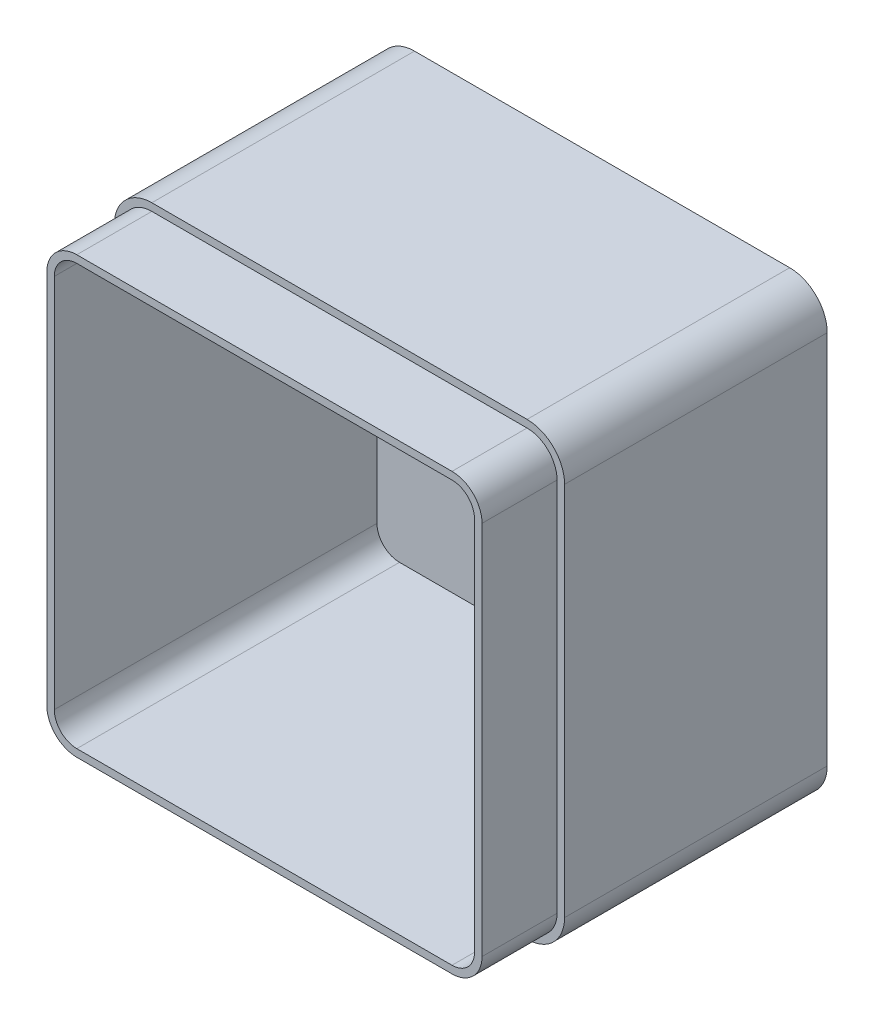
ISO-10303-21;
HEADER;
FILE_DESCRIPTION(('STEP AP214'),'2;1');
FILE_NAME('part.step','',(''),(''),'','','');
FILE_SCHEMA(('AUTOMOTIVE_DESIGN { 1 0 10303 214 1 1 1 1 }'));
ENDSEC;
DATA;
#1=APPLICATION_CONTEXT('core data for automotive mechanical design processes');
#2=APPLICATION_PROTOCOL_DEFINITION('international standard','automotive_design',2000,#1);
#3=PRODUCT_CONTEXT('',#1,'mechanical');
#4=PRODUCT('Part','Part','',(#3));
#5=PRODUCT_RELATED_PRODUCT_CATEGORY('part','',(#4));
#6=PRODUCT_DEFINITION_FORMATION('','',#4);
#7=PRODUCT_DEFINITION_CONTEXT('part definition',#1,'design');
#8=PRODUCT_DEFINITION('design','',#6,#7);
#9=PRODUCT_DEFINITION_SHAPE('','',#8);
#10=(LENGTH_UNIT() NAMED_UNIT(*) SI_UNIT(.MILLI.,.METRE.));
#11=(NAMED_UNIT(*) PLANE_ANGLE_UNIT() SI_UNIT($,.RADIAN.));
#12=(NAMED_UNIT(*) SI_UNIT($,.STERADIAN.) SOLID_ANGLE_UNIT());
#13=UNCERTAINTY_MEASURE_WITH_UNIT(LENGTH_MEASURE(1.E-05),#10,'distance_accuracy_value','');
#14=(GEOMETRIC_REPRESENTATION_CONTEXT(3) GLOBAL_UNCERTAINTY_ASSIGNED_CONTEXT((#13)) GLOBAL_UNIT_ASSIGNED_CONTEXT((#10,
#11,#12)) REPRESENTATION_CONTEXT('',''));
#15=CARTESIAN_POINT('',(0.,0.,0.));
#16=DIRECTION('',(0.,0.,1.));
#17=DIRECTION('',(1.,0.,0.));
#18=AXIS2_PLACEMENT_3D('',#15,#16,#17);
#19=CARTESIAN_POINT('',(0.,0.,90.));
#20=DIRECTION('',(0.,0.,-1.));
#21=DIRECTION('',(-1.,0.,0.));
#22=AXIS2_PLACEMENT_3D('',#19,#20,#21);
#23=PLANE('',#22);
#24=DIRECTION('',(1.,0.,0.));
#25=VECTOR('',#24,1.);
#26=CARTESIAN_POINT('',(0.,4.,90.));
#27=LINE('',#26,#25);
#28=CARTESIAN_POINT('',(9.99999999999999,4.,90.));
#29=VERTEX_POINT('',#28);
#30=CARTESIAN_POINT('',(110.,4.,90.));
#31=VERTEX_POINT('',#30);
#32=EDGE_CURVE('E317',#29,#31,#27,.T.);
#33=ORIENTED_EDGE('',*,*,#32,.F.);
#34=CARTESIAN_POINT('',(9.99999999999999,10.,90.));
#35=DIRECTION('',(0.,0.,-1.));
#36=DIRECTION('',(-1.,0.,0.));
#37=AXIS2_PLACEMENT_3D('',#34,#35,#36);
#38=CIRCLE('',#37,6.);
#39=CARTESIAN_POINT('',(4.,10.,90.));
#40=VERTEX_POINT('',#39);
#41=EDGE_CURVE('E318',#40,#29,#38,.F.);
#42=ORIENTED_EDGE('',*,*,#41,.F.);
#43=DIRECTION('',(0.,-1.,0.));
#44=VECTOR('',#43,1.);
#45=CARTESIAN_POINT('',(4.,0.,90.));
#46=LINE('',#45,#44);
#47=CARTESIAN_POINT('',(3.99999999999999,110.,90.));
#48=VERTEX_POINT('',#47);
#49=EDGE_CURVE('E299',#48,#40,#46,.T.);
#50=ORIENTED_EDGE('',*,*,#49,.F.);
#51=CARTESIAN_POINT('',(9.99999999999999,110.,90.));
#52=DIRECTION('',(0.,0.,-1.));
#53=DIRECTION('',(-1.,0.,0.));
#54=AXIS2_PLACEMENT_3D('',#51,#52,#53);
#55=CIRCLE('',#54,6.);
#56=CARTESIAN_POINT('',(9.99999999999998,116.,90.));
#57=VERTEX_POINT('',#56);
#58=EDGE_CURVE('E303',#57,#48,#55,.F.);
#59=ORIENTED_EDGE('',*,*,#58,.F.);
#60=DIRECTION('',(-1.,0.,0.));
#61=VECTOR('',#60,1.);
#62=CARTESIAN_POINT('',(0.,116.,90.));
#63=LINE('',#62,#61);
#64=CARTESIAN_POINT('',(110.,116.,90.));
#65=VERTEX_POINT('',#64);
#66=EDGE_CURVE('E310',#65,#57,#63,.T.);
#67=ORIENTED_EDGE('',*,*,#66,.F.);
#68=CARTESIAN_POINT('',(110.,110.,90.));
#69=DIRECTION('',(0.,0.,-1.));
#70=DIRECTION('',(-1.,0.,0.));
#71=AXIS2_PLACEMENT_3D('',#68,#69,#70);
#72=CIRCLE('',#71,6.);
#73=CARTESIAN_POINT('',(116.,110.,90.));
#74=VERTEX_POINT('',#73);
#75=EDGE_CURVE('E320',#74,#65,#72,.F.);
#76=ORIENTED_EDGE('',*,*,#75,.F.);
#77=DIRECTION('',(0.,1.,0.));
#78=VECTOR('',#77,1.);
#79=CARTESIAN_POINT('',(116.,0.,90.));
#80=LINE('',#79,#78);
#81=CARTESIAN_POINT('',(116.,10.,90.));
#82=VERTEX_POINT('',#81);
#83=EDGE_CURVE('E323',#82,#74,#80,.T.);
#84=ORIENTED_EDGE('',*,*,#83,.F.);
#85=CARTESIAN_POINT('',(110.,10.,90.));
#86=DIRECTION('',(0.,0.,-1.));
#87=DIRECTION('',(-1.,0.,0.));
#88=AXIS2_PLACEMENT_3D('',#85,#86,#87);
#89=CIRCLE('',#88,6.);
#90=EDGE_CURVE('E281',#31,#82,#89,.F.);
#91=ORIENTED_EDGE('',*,*,#90,.F.);
#92=EDGE_LOOP('',(#33,#42,#50,#59,#67,#76,#84,#91));
#93=FACE_BOUND('',#92,.T.);
#94=CARTESIAN_POINT('',(9.99999999999999,10.,90.));
#95=DIRECTION('',(0.,0.,-1.));
#96=DIRECTION('',(-1.,0.,0.));
#97=AXIS2_PLACEMENT_3D('',#94,#95,#96);
#98=CIRCLE('',#97,8.);
#99=CARTESIAN_POINT('',(9.99999999999999,2.,90.));
#100=VERTEX_POINT('',#99);
#101=CARTESIAN_POINT('',(1.99999999999999,9.99999999999999,90.));
#102=VERTEX_POINT('',#101);
#103=EDGE_CURVE('E11',#100,#102,#98,.T.);
#104=ORIENTED_EDGE('',*,*,#103,.F.);
#105=DIRECTION('',(-1.,0.,0.));
#106=VECTOR('',#105,1.);
#107=CARTESIAN_POINT('',(0.,2.,90.));
#108=LINE('',#107,#106);
#109=CARTESIAN_POINT('',(110.,2.,90.));
#110=VERTEX_POINT('',#109);
#111=EDGE_CURVE('E203',#110,#100,#108,.T.);
#112=ORIENTED_EDGE('',*,*,#111,.F.);
#113=CARTESIAN_POINT('',(110.,10.,90.));
#114=DIRECTION('',(0.,0.,-1.));
#115=DIRECTION('',(-1.,0.,0.));
#116=AXIS2_PLACEMENT_3D('',#113,#114,#115);
#117=CIRCLE('',#116,7.99999999999999);
#118=CARTESIAN_POINT('',(118.,10.,90.));
#119=VERTEX_POINT('',#118);
#120=EDGE_CURVE('E371',#119,#110,#117,.T.);
#121=ORIENTED_EDGE('',*,*,#120,.F.);
#122=DIRECTION('',(0.,-1.,0.));
#123=VECTOR('',#122,1.);
#124=CARTESIAN_POINT('',(118.,0.,90.));
#125=LINE('',#124,#123);
#126=CARTESIAN_POINT('',(118.,110.,90.));
#127=VERTEX_POINT('',#126);
#128=EDGE_CURVE('E373',#127,#119,#125,.T.);
#129=ORIENTED_EDGE('',*,*,#128,.F.);
#130=CARTESIAN_POINT('',(110.,110.,90.));
#131=DIRECTION('',(0.,0.,-1.));
#132=DIRECTION('',(-1.,0.,0.));
#133=AXIS2_PLACEMENT_3D('',#130,#131,#132);
#134=CIRCLE('',#133,8.);
#135=CARTESIAN_POINT('',(110.,118.,90.));
#136=VERTEX_POINT('',#135);
#137=EDGE_CURVE('E375',#136,#127,#134,.T.);
#138=ORIENTED_EDGE('',*,*,#137,.F.);
#139=DIRECTION('',(1.,0.,0.));
#140=VECTOR('',#139,1.);
#141=CARTESIAN_POINT('',(0.,118.,90.));
#142=LINE('',#141,#140);
#143=CARTESIAN_POINT('',(9.99999999999998,118.,90.));
#144=VERTEX_POINT('',#143);
#145=EDGE_CURVE('E377',#144,#136,#142,.T.);
#146=ORIENTED_EDGE('',*,*,#145,.F.);
#147=CARTESIAN_POINT('',(9.99999999999999,110.,90.));
#148=DIRECTION('',(0.,0.,-1.));
#149=DIRECTION('',(-1.,0.,0.));
#150=AXIS2_PLACEMENT_3D('',#147,#148,#149);
#151=CIRCLE('',#150,7.99999999999999);
#152=CARTESIAN_POINT('',(1.99999999999999,110.,90.));
#153=VERTEX_POINT('',#152);
#154=EDGE_CURVE('E379',#153,#144,#151,.T.);
#155=ORIENTED_EDGE('',*,*,#154,.F.);
#156=DIRECTION('',(0.,1.,0.));
#157=VECTOR('',#156,1.);
#158=CARTESIAN_POINT('',(1.99999999999999,0.,90.));
#159=LINE('',#158,#157);
#160=EDGE_CURVE('E47',#102,#153,#159,.T.);
#161=ORIENTED_EDGE('',*,*,#160,.F.);
#162=EDGE_LOOP('',(#104,#112,#121,#129,#138,#146,#155,#161));
#163=FACE_BOUND('',#162,.T.);
#164=ADVANCED_FACE('F39',(#93,#163),#23,.F.);
#165=CARTESIAN_POINT('',(4.,0.,90.));
#166=DIRECTION('',(1.,0.,0.));
#167=DIRECTION('',(0.,1.,0.));
#168=AXIS2_PLACEMENT_3D('',#165,#166,#167);
#169=PLANE('',#168);
#170=DIRECTION('',(0.,-1.,0.));
#171=VECTOR('',#170,1.);
#172=CARTESIAN_POINT('',(4.,0.,4.));
#173=LINE('',#172,#171);
#174=CARTESIAN_POINT('',(3.99999999999999,110.,4.));
#175=VERTEX_POINT('',#174);
#176=CARTESIAN_POINT('',(4.,10.,4.));
#177=VERTEX_POINT('',#176);
#178=EDGE_CURVE('E270',#175,#177,#173,.T.);
#179=ORIENTED_EDGE('',*,*,#178,.F.);
#180=DIRECTION('',(0.,0.,1.));
#181=VECTOR('',#180,1.);
#182=CARTESIAN_POINT('',(3.99999999999999,110.,90.));
#183=LINE('',#182,#181);
#184=EDGE_CURVE('E278',#48,#175,#183,.F.);
#185=ORIENTED_EDGE('',*,*,#184,.F.);
#186=ORIENTED_EDGE('',*,*,#49,.T.);
#187=DIRECTION('',(0.,0.,1.));
#188=VECTOR('',#187,1.);
#189=CARTESIAN_POINT('',(4.,10.,90.));
#190=LINE('',#189,#188);
#191=EDGE_CURVE('E274',#177,#40,#190,.T.);
#192=ORIENTED_EDGE('',*,*,#191,.F.);
#193=EDGE_LOOP('',(#179,#185,#186,#192));
#194=FACE_BOUND('',#193,.T.);
#195=ADVANCED_FACE('F411',(#194),#169,.T.);
#196=CARTESIAN_POINT('',(0.,4.,90.));
#197=DIRECTION('',(0.,1.,0.));
#198=DIRECTION('',(0.,0.,1.));
#199=AXIS2_PLACEMENT_3D('',#196,#197,#198);
#200=PLANE('',#199);
#201=DIRECTION('',(1.,0.,0.));
#202=VECTOR('',#201,1.);
#203=CARTESIAN_POINT('',(0.,4.,4.));
#204=LINE('',#203,#202);
#205=CARTESIAN_POINT('',(9.99999999999999,4.,4.));
#206=VERTEX_POINT('',#205);
#207=CARTESIAN_POINT('',(110.,4.,4.));
#208=VERTEX_POINT('',#207);
#209=EDGE_CURVE('E273',#206,#208,#204,.T.);
#210=ORIENTED_EDGE('',*,*,#209,.F.);
#211=DIRECTION('',(0.,0.,1.));
#212=VECTOR('',#211,1.);
#213=CARTESIAN_POINT('',(9.99999999999999,4.,90.));
#214=LINE('',#213,#212);
#215=EDGE_CURVE('E288',#29,#206,#214,.F.);
#216=ORIENTED_EDGE('',*,*,#215,.F.);
#217=ORIENTED_EDGE('',*,*,#32,.T.);
#218=DIRECTION('',(0.,0.,1.));
#219=VECTOR('',#218,1.);
#220=CARTESIAN_POINT('',(110.,4.,90.));
#221=LINE('',#220,#219);
#222=EDGE_CURVE('E301',#208,#31,#221,.T.);
#223=ORIENTED_EDGE('',*,*,#222,.F.);
#224=EDGE_LOOP('',(#210,#216,#217,#223));
#225=FACE_BOUND('',#224,.T.);
#226=ADVANCED_FACE('F419',(#225),#200,.T.);
#227=CARTESIAN_POINT('',(116.,0.,90.));
#228=DIRECTION('',(-1.,0.,0.));
#229=DIRECTION('',(0.,-1.,0.));
#230=AXIS2_PLACEMENT_3D('',#227,#228,#229);
#231=PLANE('',#230);
#232=ORIENTED_EDGE('',*,*,#83,.T.);
#233=DIRECTION('',(0.,0.,1.));
#234=VECTOR('',#233,1.);
#235=CARTESIAN_POINT('',(116.,110.,90.));
#236=LINE('',#235,#234);
#237=CARTESIAN_POINT('',(116.,110.,4.));
#238=VERTEX_POINT('',#237);
#239=EDGE_CURVE('E308',#238,#74,#236,.T.);
#240=ORIENTED_EDGE('',*,*,#239,.F.);
#241=DIRECTION('',(0.,1.,0.));
#242=VECTOR('',#241,1.);
#243=CARTESIAN_POINT('',(116.,0.,4.));
#244=LINE('',#243,#242);
#245=CARTESIAN_POINT('',(116.,10.,4.));
#246=VERTEX_POINT('',#245);
#247=EDGE_CURVE('E282',#246,#238,#244,.T.);
#248=ORIENTED_EDGE('',*,*,#247,.F.);
#249=DIRECTION('',(0.,0.,1.));
#250=VECTOR('',#249,1.);
#251=CARTESIAN_POINT('',(116.,10.,90.));
#252=LINE('',#251,#250);
#253=EDGE_CURVE('E296',#82,#246,#252,.F.);
#254=ORIENTED_EDGE('',*,*,#253,.F.);
#255=EDGE_LOOP('',(#232,#240,#248,#254));
#256=FACE_BOUND('',#255,.T.);
#257=ADVANCED_FACE('F491',(#256),#231,.T.);
#258=CARTESIAN_POINT('',(0.,116.,90.));
#259=DIRECTION('',(0.,-1.,0.));
#260=DIRECTION('',(0.,0.,-1.));
#261=AXIS2_PLACEMENT_3D('',#258,#259,#260);
#262=PLANE('',#261);
#263=ORIENTED_EDGE('',*,*,#66,.T.);
#264=DIRECTION('',(0.,0.,-1.));
#265=VECTOR('',#264,1.);
#266=CARTESIAN_POINT('',(9.99999999999998,116.,90.));
#267=LINE('',#266,#265);
#268=CARTESIAN_POINT('',(9.99999999999998,116.,4.));
#269=VERTEX_POINT('',#268);
#270=EDGE_CURVE('E277',#269,#57,#267,.F.);
#271=ORIENTED_EDGE('',*,*,#270,.F.);
#272=DIRECTION('',(-1.,0.,0.));
#273=VECTOR('',#272,1.);
#274=CARTESIAN_POINT('',(0.,116.,4.));
#275=LINE('',#274,#273);
#276=CARTESIAN_POINT('',(110.,116.,4.));
#277=VERTEX_POINT('',#276);
#278=EDGE_CURVE('E285',#277,#269,#275,.T.);
#279=ORIENTED_EDGE('',*,*,#278,.F.);
#280=DIRECTION('',(0.,0.,-1.));
#281=VECTOR('',#280,1.);
#282=CARTESIAN_POINT('',(110.,116.,90.));
#283=LINE('',#282,#281);
#284=EDGE_CURVE('E311',#65,#277,#283,.T.);
#285=ORIENTED_EDGE('',*,*,#284,.F.);
#286=EDGE_LOOP('',(#263,#271,#279,#285));
#287=FACE_BOUND('',#286,.T.);
#288=ADVANCED_FACE('F495',(#287),#262,.T.);
#289=CARTESIAN_POINT('',(0.,0.,4.));
#290=DIRECTION('',(0.,0.,-1.));
#291=DIRECTION('',(-1.,0.,0.));
#292=AXIS2_PLACEMENT_3D('',#289,#290,#291);
#293=PLANE('',#292);
#294=ORIENTED_EDGE('',*,*,#247,.T.);
#295=CARTESIAN_POINT('',(110.,110.,4.));
#296=DIRECTION('',(0.,0.,-1.));
#297=DIRECTION('',(-1.,0.,0.));
#298=AXIS2_PLACEMENT_3D('',#295,#296,#297);
#299=CIRCLE('',#298,6.);
#300=EDGE_CURVE('E293',#277,#238,#299,.T.);
#301=ORIENTED_EDGE('',*,*,#300,.F.);
#302=ORIENTED_EDGE('',*,*,#278,.T.);
#303=CARTESIAN_POINT('',(9.99999999999999,110.,4.));
#304=DIRECTION('',(0.,0.,-1.));
#305=DIRECTION('',(-1.,0.,0.));
#306=AXIS2_PLACEMENT_3D('',#303,#304,#305);
#307=CIRCLE('',#306,6.);
#308=EDGE_CURVE('E294',#175,#269,#307,.T.);
#309=ORIENTED_EDGE('',*,*,#308,.F.);
#310=ORIENTED_EDGE('',*,*,#178,.T.);
#311=CARTESIAN_POINT('',(9.99999999999999,10.,4.));
#312=DIRECTION('',(0.,0.,-1.));
#313=DIRECTION('',(-1.,0.,0.));
#314=AXIS2_PLACEMENT_3D('',#311,#312,#313);
#315=CIRCLE('',#314,6.);
#316=EDGE_CURVE('E289',#206,#177,#315,.T.);
#317=ORIENTED_EDGE('',*,*,#316,.F.);
#318=ORIENTED_EDGE('',*,*,#209,.T.);
#319=CARTESIAN_POINT('',(110.,10.,4.));
#320=DIRECTION('',(0.,0.,-1.));
#321=DIRECTION('',(-1.,0.,0.));
#322=AXIS2_PLACEMENT_3D('',#319,#320,#321);
#323=CIRCLE('',#322,6.);
#324=EDGE_CURVE('E286',#246,#208,#323,.T.);
#325=ORIENTED_EDGE('',*,*,#324,.F.);
#326=EDGE_LOOP('',(#294,#301,#302,#309,#310,#317,#318,#325));
#327=FACE_BOUND('',#326,.T.);
#328=ADVANCED_FACE('F499',(#327),#293,.F.);
#329=CARTESIAN_POINT('',(110.,10.,90.));
#330=DIRECTION('',(0.,0.,-1.));
#331=DIRECTION('',(-1.,0.,0.));
#332=AXIS2_PLACEMENT_3D('',#329,#330,#331);
#333=CYLINDRICAL_SURFACE('',#332,6.);
#334=ORIENTED_EDGE('',*,*,#90,.T.);
#335=ORIENTED_EDGE('',*,*,#253,.T.);
#336=ORIENTED_EDGE('',*,*,#324,.T.);
#337=ORIENTED_EDGE('',*,*,#222,.T.);
#338=EDGE_LOOP('',(#334,#335,#336,#337));
#339=FACE_BOUND('',#338,.T.);
#340=ADVANCED_FACE('F503',(#339),#333,.F.);
#341=CARTESIAN_POINT('',(9.99999999999999,10.,90.));
#342=DIRECTION('',(0.,0.,-1.));
#343=DIRECTION('',(-1.,0.,0.));
#344=AXIS2_PLACEMENT_3D('',#341,#342,#343);
#345=CYLINDRICAL_SURFACE('',#344,6.);
#346=ORIENTED_EDGE('',*,*,#41,.T.);
#347=ORIENTED_EDGE('',*,*,#215,.T.);
#348=ORIENTED_EDGE('',*,*,#316,.T.);
#349=ORIENTED_EDGE('',*,*,#191,.T.);
#350=EDGE_LOOP('',(#346,#347,#348,#349));
#351=FACE_BOUND('',#350,.T.);
#352=ADVANCED_FACE('F507',(#351),#345,.F.);
#353=CARTESIAN_POINT('',(110.,110.,90.));
#354=DIRECTION('',(0.,0.,-1.));
#355=DIRECTION('',(-1.,0.,0.));
#356=AXIS2_PLACEMENT_3D('',#353,#354,#355);
#357=CYLINDRICAL_SURFACE('',#356,6.);
#358=ORIENTED_EDGE('',*,*,#75,.T.);
#359=ORIENTED_EDGE('',*,*,#284,.T.);
#360=ORIENTED_EDGE('',*,*,#300,.T.);
#361=ORIENTED_EDGE('',*,*,#239,.T.);
#362=EDGE_LOOP('',(#358,#359,#360,#361));
#363=FACE_BOUND('',#362,.T.);
#364=ADVANCED_FACE('F510',(#363),#357,.F.);
#365=CARTESIAN_POINT('',(9.99999999999999,110.,90.));
#366=DIRECTION('',(0.,0.,-1.));
#367=DIRECTION('',(-1.,0.,0.));
#368=AXIS2_PLACEMENT_3D('',#365,#366,#367);
#369=CYLINDRICAL_SURFACE('',#368,6.);
#370=ORIENTED_EDGE('',*,*,#58,.T.);
#371=ORIENTED_EDGE('',*,*,#184,.T.);
#372=ORIENTED_EDGE('',*,*,#308,.T.);
#373=ORIENTED_EDGE('',*,*,#270,.T.);
#374=EDGE_LOOP('',(#370,#371,#372,#373));
#375=FACE_BOUND('',#374,.T.);
#376=ADVANCED_FACE('F425',(#375),#369,.F.);
#377=CARTESIAN_POINT('',(9.99999999999999,10.,70.));
#378=DIRECTION('',(0.,0.,1.));
#379=DIRECTION('',(1.,0.,0.));
#380=AXIS2_PLACEMENT_3D('',#377,#378,#379);
#381=CYLINDRICAL_SURFACE('',#380,8.);
#382=ORIENTED_EDGE('',*,*,#103,.T.);
#383=DIRECTION('',(0.,0.,1.));
#384=VECTOR('',#383,1.);
#385=CARTESIAN_POINT('',(1.99999999999999,9.99999999999999,70.));
#386=LINE('',#385,#384);
#387=CARTESIAN_POINT('',(1.99999999999999,9.99999999999999,70.));
#388=VERTEX_POINT('',#387);
#389=EDGE_CURVE('E221',#388,#102,#386,.T.);
#390=ORIENTED_EDGE('',*,*,#389,.F.);
#391=CARTESIAN_POINT('',(9.99999999999999,10.,70.));
#392=DIRECTION('',(0.,0.,1.));
#393=DIRECTION('',(1.,0.,0.));
#394=AXIS2_PLACEMENT_3D('',#391,#392,#393);
#395=CIRCLE('',#394,8.);
#396=CARTESIAN_POINT('',(9.99999999999999,2.,70.));
#397=VERTEX_POINT('',#396);
#398=EDGE_CURVE('E213',#388,#397,#395,.T.);
#399=ORIENTED_EDGE('',*,*,#398,.T.);
#400=DIRECTION('',(0.,0.,1.));
#401=VECTOR('',#400,1.);
#402=CARTESIAN_POINT('',(9.99999999999999,2.,70.));
#403=LINE('',#402,#401);
#404=EDGE_CURVE('E198',#397,#100,#403,.T.);
#405=ORIENTED_EDGE('',*,*,#404,.T.);
#406=EDGE_LOOP('',(#382,#390,#399,#405));
#407=FACE_BOUND('',#406,.T.);
#408=ADVANCED_FACE('F219',(#407),#381,.T.);
#409=CARTESIAN_POINT('',(1.99999999999999,110.,70.));
#410=DIRECTION('',(-1.,0.,0.));
#411=DIRECTION('',(0.,-1.,0.));
#412=AXIS2_PLACEMENT_3D('',#409,#410,#411);
#413=PLANE('',#412);
#414=ORIENTED_EDGE('',*,*,#160,.T.);
#415=DIRECTION('',(0.,0.,1.));
#416=VECTOR('',#415,1.);
#417=CARTESIAN_POINT('',(1.99999999999999,110.,70.));
#418=LINE('',#417,#416);
#419=CARTESIAN_POINT('',(1.99999999999999,110.,70.));
#420=VERTEX_POINT('',#419);
#421=EDGE_CURVE('E240',#420,#153,#418,.T.);
#422=ORIENTED_EDGE('',*,*,#421,.F.);
#423=DIRECTION('',(0.,-1.,0.));
#424=VECTOR('',#423,1.);
#425=CARTESIAN_POINT('',(1.99999999999999,110.,70.));
#426=LINE('',#425,#424);
#427=EDGE_CURVE('E207',#420,#388,#426,.T.);
#428=ORIENTED_EDGE('',*,*,#427,.T.);
#429=ORIENTED_EDGE('',*,*,#389,.T.);
#430=EDGE_LOOP('',(#414,#422,#428,#429));
#431=FACE_BOUND('',#430,.T.);
#432=ADVANCED_FACE('F382',(#431),#413,.T.);
#433=CARTESIAN_POINT('',(9.99999999999999,110.,70.));
#434=DIRECTION('',(0.,0.,1.));
#435=DIRECTION('',(1.,0.,0.));
#436=AXIS2_PLACEMENT_3D('',#433,#434,#435);
#437=CYLINDRICAL_SURFACE('',#436,7.99999999999999);
#438=ORIENTED_EDGE('',*,*,#154,.T.);
#439=DIRECTION('',(0.,0.,1.));
#440=VECTOR('',#439,1.);
#441=CARTESIAN_POINT('',(9.99999999999998,118.,70.));
#442=LINE('',#441,#440);
#443=CARTESIAN_POINT('',(9.99999999999998,118.,70.));
#444=VERTEX_POINT('',#443);
#445=EDGE_CURVE('E243',#444,#144,#442,.T.);
#446=ORIENTED_EDGE('',*,*,#445,.F.);
#447=CARTESIAN_POINT('',(9.99999999999999,110.,70.));
#448=DIRECTION('',(0.,0.,1.));
#449=DIRECTION('',(1.,0.,0.));
#450=AXIS2_PLACEMENT_3D('',#447,#448,#449);
#451=CIRCLE('',#450,7.99999999999999);
#452=EDGE_CURVE('E234',#444,#420,#451,.T.);
#453=ORIENTED_EDGE('',*,*,#452,.T.);
#454=ORIENTED_EDGE('',*,*,#421,.T.);
#455=EDGE_LOOP('',(#438,#446,#453,#454));
#456=FACE_BOUND('',#455,.T.);
#457=ADVANCED_FACE('F386',(#456),#437,.T.);
#458=CARTESIAN_POINT('',(110.,118.,70.));
#459=DIRECTION('',(0.,1.,0.));
#460=DIRECTION('',(0.,0.,1.));
#461=AXIS2_PLACEMENT_3D('',#458,#459,#460);
#462=PLANE('',#461);
#463=ORIENTED_EDGE('',*,*,#145,.T.);
#464=DIRECTION('',(0.,0.,1.));
#465=VECTOR('',#464,1.);
#466=CARTESIAN_POINT('',(110.,118.,70.));
#467=LINE('',#466,#465);
#468=CARTESIAN_POINT('',(110.,118.,70.));
#469=VERTEX_POINT('',#468);
#470=EDGE_CURVE('E246',#469,#136,#467,.T.);
#471=ORIENTED_EDGE('',*,*,#470,.F.);
#472=DIRECTION('',(-1.,0.,0.));
#473=VECTOR('',#472,1.);
#474=CARTESIAN_POINT('',(110.,118.,70.));
#475=LINE('',#474,#473);
#476=EDGE_CURVE('E231',#469,#444,#475,.T.);
#477=ORIENTED_EDGE('',*,*,#476,.T.);
#478=ORIENTED_EDGE('',*,*,#445,.T.);
#479=EDGE_LOOP('',(#463,#471,#477,#478));
#480=FACE_BOUND('',#479,.T.);
#481=ADVANCED_FACE('F392',(#480),#462,.T.);
#482=CARTESIAN_POINT('',(110.,110.,70.));
#483=DIRECTION('',(0.,0.,1.));
#484=DIRECTION('',(1.,0.,0.));
#485=AXIS2_PLACEMENT_3D('',#482,#483,#484);
#486=CYLINDRICAL_SURFACE('',#485,8.);
#487=ORIENTED_EDGE('',*,*,#137,.T.);
#488=DIRECTION('',(0.,0.,1.));
#489=VECTOR('',#488,1.);
#490=CARTESIAN_POINT('',(118.,110.,70.));
#491=LINE('',#490,#489);
#492=CARTESIAN_POINT('',(118.,110.,70.));
#493=VERTEX_POINT('',#492);
#494=EDGE_CURVE('E249',#493,#127,#491,.T.);
#495=ORIENTED_EDGE('',*,*,#494,.F.);
#496=CARTESIAN_POINT('',(110.,110.,70.));
#497=DIRECTION('',(0.,0.,1.));
#498=DIRECTION('',(1.,0.,0.));
#499=AXIS2_PLACEMENT_3D('',#496,#497,#498);
#500=CIRCLE('',#499,8.);
#501=EDGE_CURVE('E228',#493,#469,#500,.T.);
#502=ORIENTED_EDGE('',*,*,#501,.T.);
#503=ORIENTED_EDGE('',*,*,#470,.T.);
#504=EDGE_LOOP('',(#487,#495,#502,#503));
#505=FACE_BOUND('',#504,.T.);
#506=ADVANCED_FACE('F395',(#505),#486,.T.);
#507=CARTESIAN_POINT('',(118.,9.99999999999999,70.));
#508=DIRECTION('',(1.,0.,0.));
#509=DIRECTION('',(0.,0.,-1.));
#510=AXIS2_PLACEMENT_3D('',#507,#508,#509);
#511=PLANE('',#510);
#512=ORIENTED_EDGE('',*,*,#128,.T.);
#513=DIRECTION('',(0.,0.,1.));
#514=VECTOR('',#513,1.);
#515=CARTESIAN_POINT('',(118.,10.,70.));
#516=LINE('',#515,#514);
#517=CARTESIAN_POINT('',(118.,10.,70.));
#518=VERTEX_POINT('',#517);
#519=EDGE_CURVE('E252',#518,#119,#516,.T.);
#520=ORIENTED_EDGE('',*,*,#519,.F.);
#521=DIRECTION('',(0.,1.,0.));
#522=VECTOR('',#521,1.);
#523=CARTESIAN_POINT('',(118.,9.99999999999999,70.));
#524=LINE('',#523,#522);
#525=EDGE_CURVE('E225',#518,#493,#524,.T.);
#526=ORIENTED_EDGE('',*,*,#525,.T.);
#527=ORIENTED_EDGE('',*,*,#494,.T.);
#528=EDGE_LOOP('',(#512,#520,#526,#527));
#529=FACE_BOUND('',#528,.T.);
#530=ADVANCED_FACE('F398',(#529),#511,.T.);
#531=CARTESIAN_POINT('',(110.,10.,70.));
#532=DIRECTION('',(0.,0.,1.));
#533=DIRECTION('',(1.,0.,0.));
#534=AXIS2_PLACEMENT_3D('',#531,#532,#533);
#535=CYLINDRICAL_SURFACE('',#534,7.99999999999999);
#536=ORIENTED_EDGE('',*,*,#120,.T.);
#537=DIRECTION('',(0.,0.,1.));
#538=VECTOR('',#537,1.);
#539=CARTESIAN_POINT('',(110.,2.,70.));
#540=LINE('',#539,#538);
#541=CARTESIAN_POINT('',(110.,2.,70.));
#542=VERTEX_POINT('',#541);
#543=EDGE_CURVE('E54',#542,#110,#540,.T.);
#544=ORIENTED_EDGE('',*,*,#543,.F.);
#545=CARTESIAN_POINT('',(110.,10.,70.));
#546=DIRECTION('',(0.,0.,1.));
#547=DIRECTION('',(1.,0.,0.));
#548=AXIS2_PLACEMENT_3D('',#545,#546,#547);
#549=CIRCLE('',#548,7.99999999999999);
#550=EDGE_CURVE('E217',#542,#518,#549,.T.);
#551=ORIENTED_EDGE('',*,*,#550,.T.);
#552=ORIENTED_EDGE('',*,*,#519,.T.);
#553=EDGE_LOOP('',(#536,#544,#551,#552));
#554=FACE_BOUND('',#553,.T.);
#555=ADVANCED_FACE('F401',(#554),#535,.T.);
#556=CARTESIAN_POINT('',(9.99999999999999,2.,70.));
#557=DIRECTION('',(0.,-1.,0.));
#558=DIRECTION('',(0.,0.,-1.));
#559=AXIS2_PLACEMENT_3D('',#556,#557,#558);
#560=PLANE('',#559);
#561=ORIENTED_EDGE('',*,*,#111,.T.);
#562=ORIENTED_EDGE('',*,*,#404,.F.);
#563=DIRECTION('',(1.,0.,0.));
#564=VECTOR('',#563,1.);
#565=CARTESIAN_POINT('',(9.99999999999999,2.,70.));
#566=LINE('',#565,#564);
#567=EDGE_CURVE('E201',#397,#542,#566,.T.);
#568=ORIENTED_EDGE('',*,*,#567,.T.);
#569=ORIENTED_EDGE('',*,*,#543,.T.);
#570=EDGE_LOOP('',(#561,#562,#568,#569));
#571=FACE_BOUND('',#570,.T.);
#572=ADVANCED_FACE('F200',(#571),#560,.T.);
#573=CARTESIAN_POINT('',(9.99999999999999,10.,70.));
#574=DIRECTION('',(0.,0.,1.));
#575=DIRECTION('',(1.,0.,0.));
#576=AXIS2_PLACEMENT_3D('',#573,#574,#575);
#577=PLANE('',#576);
#578=ORIENTED_EDGE('',*,*,#427,.F.);
#579=ORIENTED_EDGE('',*,*,#452,.F.);
#580=ORIENTED_EDGE('',*,*,#476,.F.);
#581=ORIENTED_EDGE('',*,*,#501,.F.);
#582=ORIENTED_EDGE('',*,*,#525,.F.);
#583=ORIENTED_EDGE('',*,*,#550,.F.);
#584=ORIENTED_EDGE('',*,*,#567,.F.);
#585=ORIENTED_EDGE('',*,*,#398,.F.);
#586=EDGE_LOOP('',(#578,#579,#580,#581,#582,#583,#584,#585));
#587=FACE_BOUND('',#586,.T.);
#588=CARTESIAN_POINT('',(9.99999999999999,10.,70.));
#589=DIRECTION('',(0.,0.,1.));
#590=DIRECTION('',(1.,0.,0.));
#591=AXIS2_PLACEMENT_3D('',#588,#589,#590);
#592=CIRCLE('',#591,10.);
#593=CARTESIAN_POINT('',(0.,10.,70.));
#594=VERTEX_POINT('',#593);
#595=CARTESIAN_POINT('',(9.99999999999999,0.,70.));
#596=VERTEX_POINT('',#595);
#597=EDGE_CURVE('E239',#594,#596,#592,.T.);
#598=ORIENTED_EDGE('',*,*,#597,.T.);
#599=DIRECTION('',(1.,0.,0.));
#600=VECTOR('',#599,1.);
#601=CARTESIAN_POINT('',(9.99999999999999,0.,70.));
#602=LINE('',#601,#600);
#603=CARTESIAN_POINT('',(110.,0.,70.));
#604=VERTEX_POINT('',#603);
#605=EDGE_CURVE('E257',#596,#604,#602,.T.);
#606=ORIENTED_EDGE('',*,*,#605,.T.);
#607=CARTESIAN_POINT('',(110.,10.,70.));
#608=DIRECTION('',(0.,0.,1.));
#609=DIRECTION('',(1.,0.,0.));
#610=AXIS2_PLACEMENT_3D('',#607,#608,#609);
#611=CIRCLE('',#610,9.99999999999999);
#612=CARTESIAN_POINT('',(120.,10.,70.));
#613=VERTEX_POINT('',#612);
#614=EDGE_CURVE('E259',#604,#613,#611,.T.);
#615=ORIENTED_EDGE('',*,*,#614,.T.);
#616=DIRECTION('',(0.,1.,0.));
#617=VECTOR('',#616,1.);
#618=CARTESIAN_POINT('',(120.,10.,70.));
#619=LINE('',#618,#617);
#620=CARTESIAN_POINT('',(120.,110.,70.));
#621=VERTEX_POINT('',#620);
#622=EDGE_CURVE('E261',#613,#621,#619,.T.);
#623=ORIENTED_EDGE('',*,*,#622,.T.);
#624=CARTESIAN_POINT('',(110.,110.,70.));
#625=DIRECTION('',(0.,0.,1.));
#626=DIRECTION('',(1.,0.,0.));
#627=AXIS2_PLACEMENT_3D('',#624,#625,#626);
#628=CIRCLE('',#627,9.99999999999999);
#629=CARTESIAN_POINT('',(110.,120.,70.));
#630=VERTEX_POINT('',#629);
#631=EDGE_CURVE('E263',#621,#630,#628,.T.);
#632=ORIENTED_EDGE('',*,*,#631,.T.);
#633=DIRECTION('',(-1.,0.,0.));
#634=VECTOR('',#633,1.);
#635=CARTESIAN_POINT('',(110.,120.,70.));
#636=LINE('',#635,#634);
#637=CARTESIAN_POINT('',(9.99999999999999,120.,70.));
#638=VERTEX_POINT('',#637);
#639=EDGE_CURVE('E62',#630,#638,#636,.T.);
#640=ORIENTED_EDGE('',*,*,#639,.T.);
#641=CARTESIAN_POINT('',(9.99999999999999,110.,70.));
#642=DIRECTION('',(0.,0.,1.));
#643=DIRECTION('',(1.,0.,0.));
#644=AXIS2_PLACEMENT_3D('',#641,#642,#643);
#645=CIRCLE('',#644,9.99999999999999);
#646=CARTESIAN_POINT('',(0.,110.,70.));
#647=VERTEX_POINT('',#646);
#648=EDGE_CURVE('E266',#638,#647,#645,.T.);
#649=ORIENTED_EDGE('',*,*,#648,.T.);
#650=DIRECTION('',(0.,-1.,0.));
#651=VECTOR('',#650,1.);
#652=CARTESIAN_POINT('',(0.,110.,70.));
#653=LINE('',#652,#651);
#654=EDGE_CURVE('E268',#647,#594,#653,.T.);
#655=ORIENTED_EDGE('',*,*,#654,.T.);
#656=EDGE_LOOP('',(#598,#606,#615,#623,#632,#640,#649,#655));
#657=FACE_BOUND('',#656,.T.);
#658=ADVANCED_FACE('F212',(#587,#657),#577,.T.);
#659=CARTESIAN_POINT('',(0.,0.,0.));
#660=DIRECTION('',(0.,0.,-1.));
#661=DIRECTION('',(-1.,0.,0.));
#662=AXIS2_PLACEMENT_3D('',#659,#660,#661);
#663=PLANE('',#662);
#664=DIRECTION('',(0.,1.,0.));
#665=VECTOR('',#664,1.);
#666=CARTESIAN_POINT('',(120.,0.,0.));
#667=LINE('',#666,#665);
#668=CARTESIAN_POINT('',(120.,10.,0.));
#669=VERTEX_POINT('',#668);
#670=CARTESIAN_POINT('',(120.,110.,0.));
#671=VERTEX_POINT('',#670);
#672=EDGE_CURVE('E336',#669,#671,#667,.T.);
#673=ORIENTED_EDGE('',*,*,#672,.F.);
#674=CARTESIAN_POINT('',(110.,10.,0.));
#675=DIRECTION('',(0.,0.,-1.));
#676=DIRECTION('',(-1.,0.,0.));
#677=AXIS2_PLACEMENT_3D('',#674,#675,#676);
#678=CIRCLE('',#677,10.);
#679=CARTESIAN_POINT('',(110.,0.,0.));
#680=VERTEX_POINT('',#679);
#681=EDGE_CURVE('E353',#669,#680,#678,.T.);
#682=ORIENTED_EDGE('',*,*,#681,.T.);
#683=DIRECTION('',(1.,0.,0.));
#684=VECTOR('',#683,1.);
#685=CARTESIAN_POINT('',(0.,0.,0.));
#686=LINE('',#685,#684);
#687=CARTESIAN_POINT('',(9.99999999999999,0.,0.));
#688=VERTEX_POINT('',#687);
#689=EDGE_CURVE('E333',#688,#680,#686,.T.);
#690=ORIENTED_EDGE('',*,*,#689,.F.);
#691=CARTESIAN_POINT('',(9.99999999999999,10.,0.));
#692=DIRECTION('',(0.,0.,-1.));
#693=DIRECTION('',(-1.,0.,0.));
#694=AXIS2_PLACEMENT_3D('',#691,#692,#693);
#695=CIRCLE('',#694,10.);
#696=CARTESIAN_POINT('',(0.,10.,0.));
#697=VERTEX_POINT('',#696);
#698=EDGE_CURVE('E351',#688,#697,#695,.T.);
#699=ORIENTED_EDGE('',*,*,#698,.T.);
#700=DIRECTION('',(0.,-1.,0.));
#701=VECTOR('',#700,1.);
#702=CARTESIAN_POINT('',(0.,0.,0.));
#703=LINE('',#702,#701);
#704=CARTESIAN_POINT('',(0.,110.,0.));
#705=VERTEX_POINT('',#704);
#706=EDGE_CURVE('E314',#705,#697,#703,.T.);
#707=ORIENTED_EDGE('',*,*,#706,.F.);
#708=CARTESIAN_POINT('',(9.99999999999999,110.,0.));
#709=DIRECTION('',(0.,0.,-1.));
#710=DIRECTION('',(-1.,0.,0.));
#711=AXIS2_PLACEMENT_3D('',#708,#709,#710);
#712=CIRCLE('',#711,10.);
#713=CARTESIAN_POINT('',(9.99999999999998,120.,0.));
#714=VERTEX_POINT('',#713);
#715=EDGE_CURVE('E347',#705,#714,#712,.T.);
#716=ORIENTED_EDGE('',*,*,#715,.T.);
#717=DIRECTION('',(-1.,0.,0.));
#718=VECTOR('',#717,1.);
#719=CARTESIAN_POINT('',(0.,120.,0.));
#720=LINE('',#719,#718);
#721=CARTESIAN_POINT('',(110.,120.,0.));
#722=VERTEX_POINT('',#721);
#723=EDGE_CURVE('E339',#722,#714,#720,.T.);
#724=ORIENTED_EDGE('',*,*,#723,.F.);
#725=CARTESIAN_POINT('',(110.,110.,0.));
#726=DIRECTION('',(0.,0.,-1.));
#727=DIRECTION('',(-1.,0.,0.));
#728=AXIS2_PLACEMENT_3D('',#725,#726,#727);
#729=CIRCLE('',#728,10.);
#730=EDGE_CURVE('E349',#722,#671,#729,.T.);
#731=ORIENTED_EDGE('',*,*,#730,.T.);
#732=EDGE_LOOP('',(#673,#682,#690,#699,#707,#716,#724,#731));
#733=FACE_BOUND('',#732,.T.);
#734=ADVANCED_FACE('F427',(#733),#663,.T.);
#735=CARTESIAN_POINT('',(9.99999999999999,110.,90.));
#736=DIRECTION('',(0.,0.,-1.));
#737=DIRECTION('',(-1.,0.,0.));
#738=AXIS2_PLACEMENT_3D('',#735,#736,#737);
#739=CYLINDRICAL_SURFACE('',#738,10.);
#740=DIRECTION('',(0.,0.,-1.));
#741=VECTOR('',#740,1.);
#742=CARTESIAN_POINT('',(0.,110.,90.));
#743=LINE('',#742,#741);
#744=EDGE_CURVE('E360',#647,#705,#743,.T.);
#745=ORIENTED_EDGE('',*,*,#744,.F.);
#746=ORIENTED_EDGE('',*,*,#648,.F.);
#747=DIRECTION('',(0.,0.,-1.));
#748=VECTOR('',#747,1.);
#749=CARTESIAN_POINT('',(9.99999999999999,120.,90.));
#750=LINE('',#749,#748);
#751=EDGE_CURVE('E365',#714,#638,#750,.F.);
#752=ORIENTED_EDGE('',*,*,#751,.F.);
#753=ORIENTED_EDGE('',*,*,#715,.F.);
#754=EDGE_LOOP('',(#745,#746,#752,#753));
#755=FACE_BOUND('',#754,.T.);
#756=ADVANCED_FACE('F41',(#755),#739,.T.);
#757=CARTESIAN_POINT('',(110.,110.,90.));
#758=DIRECTION('',(0.,0.,-1.));
#759=DIRECTION('',(-1.,0.,0.));
#760=AXIS2_PLACEMENT_3D('',#757,#758,#759);
#761=CYLINDRICAL_SURFACE('',#760,10.);
#762=DIRECTION('',(0.,0.,-1.));
#763=VECTOR('',#762,1.);
#764=CARTESIAN_POINT('',(110.,120.,90.));
#765=LINE('',#764,#763);
#766=EDGE_CURVE('E368',#630,#722,#765,.T.);
#767=ORIENTED_EDGE('',*,*,#766,.F.);
#768=ORIENTED_EDGE('',*,*,#631,.F.);
#769=DIRECTION('',(0.,0.,-1.));
#770=VECTOR('',#769,1.);
#771=CARTESIAN_POINT('',(120.,110.,90.));
#772=LINE('',#771,#770);
#773=EDGE_CURVE('E342',#671,#621,#772,.F.);
#774=ORIENTED_EDGE('',*,*,#773,.F.);
#775=ORIENTED_EDGE('',*,*,#730,.F.);
#776=EDGE_LOOP('',(#767,#768,#774,#775));
#777=FACE_BOUND('',#776,.T.);
#778=ADVANCED_FACE('F435',(#777),#761,.T.);
#779=CARTESIAN_POINT('',(0.,120.,90.));
#780=DIRECTION('',(0.,-1.,0.));
#781=DIRECTION('',(0.,0.,-1.));
#782=AXIS2_PLACEMENT_3D('',#779,#780,#781);
#783=PLANE('',#782);
#784=ORIENTED_EDGE('',*,*,#639,.F.);
#785=ORIENTED_EDGE('',*,*,#766,.T.);
#786=ORIENTED_EDGE('',*,*,#723,.T.);
#787=ORIENTED_EDGE('',*,*,#751,.T.);
#788=EDGE_LOOP('',(#784,#785,#786,#787));
#789=FACE_BOUND('',#788,.T.);
#790=ADVANCED_FACE('F431',(#789),#783,.F.);
#791=CARTESIAN_POINT('',(110.,10.,90.));
#792=DIRECTION('',(0.,0.,-1.));
#793=DIRECTION('',(-1.,0.,0.));
#794=AXIS2_PLACEMENT_3D('',#791,#792,#793);
#795=CYLINDRICAL_SURFACE('',#794,10.);
#796=DIRECTION('',(0.,0.,-1.));
#797=VECTOR('',#796,1.);
#798=CARTESIAN_POINT('',(120.,10.,90.));
#799=LINE('',#798,#797);
#800=EDGE_CURVE('E345',#613,#669,#799,.T.);
#801=ORIENTED_EDGE('',*,*,#800,.F.);
#802=ORIENTED_EDGE('',*,*,#614,.F.);
#803=DIRECTION('',(0.,0.,-1.));
#804=VECTOR('',#803,1.);
#805=CARTESIAN_POINT('',(110.,0.,90.));
#806=LINE('',#805,#804);
#807=EDGE_CURVE('E357',#680,#604,#806,.F.);
#808=ORIENTED_EDGE('',*,*,#807,.F.);
#809=ORIENTED_EDGE('',*,*,#681,.F.);
#810=EDGE_LOOP('',(#801,#802,#808,#809));
#811=FACE_BOUND('',#810,.T.);
#812=ADVANCED_FACE('F434',(#811),#795,.T.);
#813=CARTESIAN_POINT('',(120.,0.,90.));
#814=DIRECTION('',(-1.,0.,0.));
#815=DIRECTION('',(0.,-1.,0.));
#816=AXIS2_PLACEMENT_3D('',#813,#814,#815);
#817=PLANE('',#816);
#818=ORIENTED_EDGE('',*,*,#622,.F.);
#819=ORIENTED_EDGE('',*,*,#800,.T.);
#820=ORIENTED_EDGE('',*,*,#672,.T.);
#821=ORIENTED_EDGE('',*,*,#773,.T.);
#822=EDGE_LOOP('',(#818,#819,#820,#821));
#823=FACE_BOUND('',#822,.T.);
#824=ADVANCED_FACE('F437',(#823),#817,.F.);
#825=CARTESIAN_POINT('',(9.99999999999999,10.,90.));
#826=DIRECTION('',(0.,0.,-1.));
#827=DIRECTION('',(-1.,0.,0.));
#828=AXIS2_PLACEMENT_3D('',#825,#826,#827);
#829=CYLINDRICAL_SURFACE('',#828,10.);
#830=DIRECTION('',(0.,0.,-1.));
#831=VECTOR('',#830,1.);
#832=CARTESIAN_POINT('',(9.99999999999999,0.,90.));
#833=LINE('',#832,#831);
#834=EDGE_CURVE('E355',#596,#688,#833,.T.);
#835=ORIENTED_EDGE('',*,*,#834,.F.);
#836=ORIENTED_EDGE('',*,*,#597,.F.);
#837=DIRECTION('',(0.,0.,-1.));
#838=VECTOR('',#837,1.);
#839=CARTESIAN_POINT('',(0.,10.,90.));
#840=LINE('',#839,#838);
#841=EDGE_CURVE('E362',#697,#594,#840,.F.);
#842=ORIENTED_EDGE('',*,*,#841,.F.);
#843=ORIENTED_EDGE('',*,*,#698,.F.);
#844=EDGE_LOOP('',(#835,#836,#842,#843));
#845=FACE_BOUND('',#844,.T.);
#846=ADVANCED_FACE('F440',(#845),#829,.T.);
#847=CARTESIAN_POINT('',(0.,0.,90.));
#848=DIRECTION('',(0.,1.,0.));
#849=DIRECTION('',(0.,0.,1.));
#850=AXIS2_PLACEMENT_3D('',#847,#848,#849);
#851=PLANE('',#850);
#852=ORIENTED_EDGE('',*,*,#605,.F.);
#853=ORIENTED_EDGE('',*,*,#834,.T.);
#854=ORIENTED_EDGE('',*,*,#689,.T.);
#855=ORIENTED_EDGE('',*,*,#807,.T.);
#856=EDGE_LOOP('',(#852,#853,#854,#855));
#857=FACE_BOUND('',#856,.T.);
#858=ADVANCED_FACE('F442',(#857),#851,.F.);
#859=CARTESIAN_POINT('',(0.,0.,90.));
#860=DIRECTION('',(1.,0.,0.));
#861=DIRECTION('',(0.,1.,0.));
#862=AXIS2_PLACEMENT_3D('',#859,#860,#861);
#863=PLANE('',#862);
#864=ORIENTED_EDGE('',*,*,#654,.F.);
#865=ORIENTED_EDGE('',*,*,#744,.T.);
#866=ORIENTED_EDGE('',*,*,#706,.T.);
#867=ORIENTED_EDGE('',*,*,#841,.T.);
#868=EDGE_LOOP('',(#864,#865,#866,#867));
#869=FACE_BOUND('',#868,.T.);
#870=ADVANCED_FACE('F445',(#869),#863,.F.);
#871=CLOSED_SHELL('',(#164,#195,#226,#257,#288,#328,#340,#352,#364,#376,#408,#432,#457,#481,
#506,#530,#555,#572,#658,#734,#756,#778,#790,#812,#824,#846,#858,#870));
#872=MANIFOLD_SOLID_BREP('B2',#871);
#873=ADVANCED_BREP_SHAPE_REPRESENTATION('',(#18,#872),#14);
#874=SHAPE_DEFINITION_REPRESENTATION(#9,#873);
ENDSEC;
END-ISO-10303-21;
